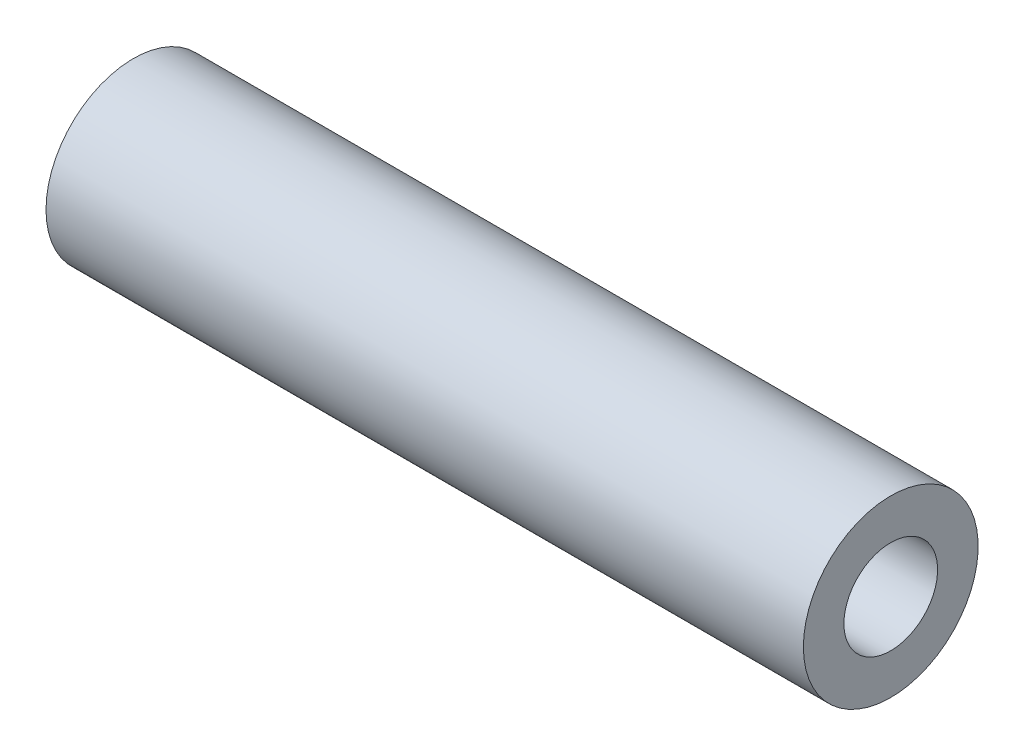
ISO-10303-21;
HEADER;
FILE_DESCRIPTION(('STEP AP214'),'2;1');
FILE_NAME('part.step','',(''),(''),'','','');
FILE_SCHEMA(('AUTOMOTIVE_DESIGN { 1 0 10303 214 1 1 1 1 }'));
ENDSEC;
DATA;
#1=APPLICATION_CONTEXT('core data for automotive mechanical design processes');
#2=APPLICATION_PROTOCOL_DEFINITION('international standard','automotive_design',2000,#1);
#3=PRODUCT_CONTEXT('',#1,'mechanical');
#4=PRODUCT('Part','Part','',(#3));
#5=PRODUCT_RELATED_PRODUCT_CATEGORY('part','',(#4));
#6=PRODUCT_DEFINITION_FORMATION('','',#4);
#7=PRODUCT_DEFINITION_CONTEXT('part definition',#1,'design');
#8=PRODUCT_DEFINITION('design','',#6,#7);
#9=PRODUCT_DEFINITION_SHAPE('','',#8);
#10=(LENGTH_UNIT() NAMED_UNIT(*) SI_UNIT(.MILLI.,.METRE.));
#11=(NAMED_UNIT(*) PLANE_ANGLE_UNIT() SI_UNIT($,.RADIAN.));
#12=(NAMED_UNIT(*) SI_UNIT($,.STERADIAN.) SOLID_ANGLE_UNIT());
#13=UNCERTAINTY_MEASURE_WITH_UNIT(LENGTH_MEASURE(1.E-05),#10,'distance_accuracy_value','');
#14=(GEOMETRIC_REPRESENTATION_CONTEXT(3) GLOBAL_UNCERTAINTY_ASSIGNED_CONTEXT((#13)) GLOBAL_UNIT_ASSIGNED_CONTEXT((#10,
#11,#12)) REPRESENTATION_CONTEXT('',''));
#15=CARTESIAN_POINT('',(0.,0.,0.));
#16=DIRECTION('',(0.,0.,1.));
#17=DIRECTION('',(1.,0.,0.));
#18=AXIS2_PLACEMENT_3D('',#15,#16,#17);
#19=CARTESIAN_POINT('',(20.6375,0.,0.));
#20=DIRECTION('',(-1.,0.,0.));
#21=DIRECTION('',(0.,0.,1.));
#22=AXIS2_PLACEMENT_3D('',#19,#20,#21);
#23=CYLINDRICAL_SURFACE('',#22,2.5527);
#24=CARTESIAN_POINT('',(-20.6375,0.,0.));
#25=DIRECTION('',(-1.,0.,0.));
#26=DIRECTION('',(0.,0.,1.));
#27=AXIS2_PLACEMENT_3D('',#24,#25,#26);
#28=CIRCLE('',#27,2.5527);
#29=CARTESIAN_POINT('',(-20.6375,0.,2.5527));
#30=VERTEX_POINT('',#29);
#31=EDGE_CURVE('E28',#30,#30,#28,.T.);
#32=ORIENTED_EDGE('',*,*,#31,.T.);
#33=EDGE_LOOP('',(#32));
#34=FACE_BOUND('',#33,.T.);
#35=CARTESIAN_POINT('',(20.6375,0.,0.));
#36=DIRECTION('',(-1.,0.,0.));
#37=DIRECTION('',(0.,0.,1.));
#38=AXIS2_PLACEMENT_3D('',#35,#36,#37);
#39=CIRCLE('',#38,2.5527);
#40=CARTESIAN_POINT('',(20.6375,0.,2.5527));
#41=VERTEX_POINT('',#40);
#42=EDGE_CURVE('E19',#41,#41,#39,.T.);
#43=ORIENTED_EDGE('',*,*,#42,.F.);
#44=EDGE_LOOP('',(#43));
#45=FACE_BOUND('',#44,.T.);
#46=ADVANCED_FACE('F16',(#34,#45),#23,.F.);
#47=CARTESIAN_POINT('',(20.6375,0.,0.));
#48=DIRECTION('',(1.,0.,0.));
#49=DIRECTION('',(0.,0.,-1.));
#50=AXIS2_PLACEMENT_3D('',#47,#48,#49);
#51=PLANE('',#50);
#52=ORIENTED_EDGE('',*,*,#42,.T.);
#53=EDGE_LOOP('',(#52));
#54=FACE_BOUND('',#53,.T.);
#55=CARTESIAN_POINT('',(20.6375,0.,0.));
#56=DIRECTION('',(-1.,0.,0.));
#57=DIRECTION('',(0.,0.,1.));
#58=AXIS2_PLACEMENT_3D('',#55,#56,#57);
#59=CIRCLE('',#58,4.7625);
#60=CARTESIAN_POINT('',(20.6375,0.,4.7625));
#61=VERTEX_POINT('',#60);
#62=EDGE_CURVE('E23',#61,#61,#59,.T.);
#63=ORIENTED_EDGE('',*,*,#62,.F.);
#64=EDGE_LOOP('',(#63));
#65=FACE_BOUND('',#64,.T.);
#66=ADVANCED_FACE('F36',(#54,#65),#51,.T.);
#67=CARTESIAN_POINT('',(-20.6375,0.,0.));
#68=DIRECTION('',(1.,0.,0.));
#69=DIRECTION('',(0.,0.,-1.));
#70=AXIS2_PLACEMENT_3D('',#67,#68,#69);
#71=PLANE('',#70);
#72=ORIENTED_EDGE('',*,*,#31,.F.);
#73=EDGE_LOOP('',(#72));
#74=FACE_BOUND('',#73,.T.);
#75=CARTESIAN_POINT('',(-20.6375,0.,0.));
#76=DIRECTION('',(-1.,0.,0.));
#77=DIRECTION('',(0.,0.,1.));
#78=AXIS2_PLACEMENT_3D('',#75,#76,#77);
#79=CIRCLE('',#78,4.7625);
#80=CARTESIAN_POINT('',(-20.6375,0.,4.7625));
#81=VERTEX_POINT('',#80);
#82=EDGE_CURVE('E10',#81,#81,#79,.F.);
#83=ORIENTED_EDGE('',*,*,#82,.F.);
#84=EDGE_LOOP('',(#83));
#85=FACE_BOUND('',#84,.T.);
#86=ADVANCED_FACE('F43',(#74,#85),#71,.F.);
#87=CARTESIAN_POINT('',(20.6375,0.,0.));
#88=DIRECTION('',(-1.,0.,0.));
#89=DIRECTION('',(0.,0.,1.));
#90=AXIS2_PLACEMENT_3D('',#87,#88,#89);
#91=CYLINDRICAL_SURFACE('',#90,4.7625);
#92=ORIENTED_EDGE('',*,*,#82,.T.);
#93=EDGE_LOOP('',(#92));
#94=FACE_BOUND('',#93,.T.);
#95=ORIENTED_EDGE('',*,*,#62,.T.);
#96=EDGE_LOOP('',(#95));
#97=FACE_BOUND('',#96,.T.);
#98=ADVANCED_FACE('F44',(#94,#97),#91,.T.);
#99=CLOSED_SHELL('',(#46,#66,#86,#98));
#100=MANIFOLD_SOLID_BREP('B1',#99);
#101=ADVANCED_BREP_SHAPE_REPRESENTATION('',(#18,#100),#14);
#102=SHAPE_DEFINITION_REPRESENTATION(#9,#101);
ENDSEC;
END-ISO-10303-21;
